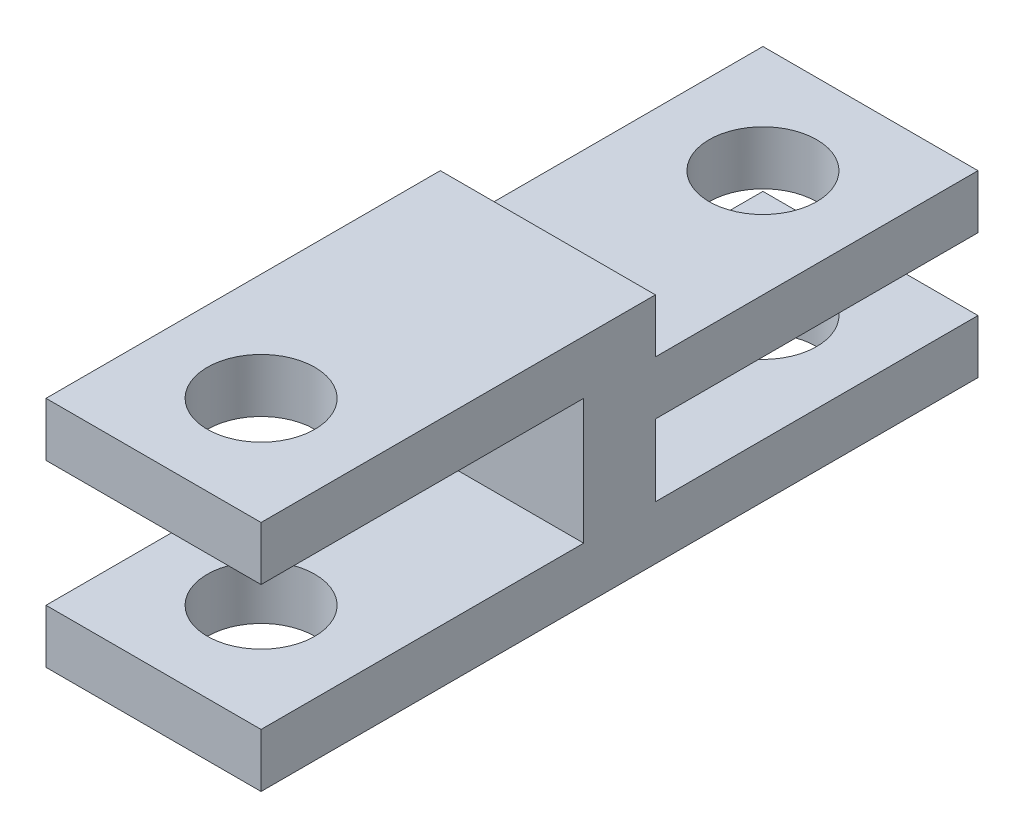
ISO-10303-21;
HEADER;
FILE_DESCRIPTION(('STEP AP214'),'2;1');
FILE_NAME('part.step','',(''),(''),'','','');
FILE_SCHEMA(('AUTOMOTIVE_DESIGN { 1 0 10303 214 1 1 1 1 }'));
ENDSEC;
DATA;
#1=APPLICATION_CONTEXT('core data for automotive mechanical design processes');
#2=APPLICATION_PROTOCOL_DEFINITION('international standard','automotive_design',2000,#1);
#3=PRODUCT_CONTEXT('',#1,'mechanical');
#4=PRODUCT('Part','Part','',(#3));
#5=PRODUCT_RELATED_PRODUCT_CATEGORY('part','',(#4));
#6=PRODUCT_DEFINITION_FORMATION('','',#4);
#7=PRODUCT_DEFINITION_CONTEXT('part definition',#1,'design');
#8=PRODUCT_DEFINITION('design','',#6,#7);
#9=PRODUCT_DEFINITION_SHAPE('','',#8);
#10=(LENGTH_UNIT() NAMED_UNIT(*) SI_UNIT(.MILLI.,.METRE.));
#11=(NAMED_UNIT(*) PLANE_ANGLE_UNIT() SI_UNIT($,.RADIAN.));
#12=(NAMED_UNIT(*) SI_UNIT($,.STERADIAN.) SOLID_ANGLE_UNIT());
#13=UNCERTAINTY_MEASURE_WITH_UNIT(LENGTH_MEASURE(1.E-05),#10,'distance_accuracy_value','');
#14=(GEOMETRIC_REPRESENTATION_CONTEXT(3) GLOBAL_UNCERTAINTY_ASSIGNED_CONTEXT((#13)) GLOBAL_UNIT_ASSIGNED_CONTEXT((#10,
#11,#12)) REPRESENTATION_CONTEXT('',''));
#15=CARTESIAN_POINT('',(0.,0.,0.));
#16=DIRECTION('',(0.,0.,1.));
#17=DIRECTION('',(1.,0.,0.));
#18=AXIS2_PLACEMENT_3D('',#15,#16,#17);
#19=CARTESIAN_POINT('',(6.,1.5,0.));
#20=DIRECTION('',(0.,0.,1.));
#21=DIRECTION('',(0.,-1.,0.));
#22=AXIS2_PLACEMENT_3D('',#19,#20,#21);
#23=PLANE('',#22);
#24=DIRECTION('',(0.,1.,0.));
#25=VECTOR('',#24,1.);
#26=CARTESIAN_POINT('',(0.,1.5,0.));
#27=LINE('',#26,#25);
#28=CARTESIAN_POINT('',(0.,0.,0.));
#29=VERTEX_POINT('',#28);
#30=CARTESIAN_POINT('',(0.,1.5,0.));
#31=VERTEX_POINT('',#30);
#32=EDGE_CURVE('E169',#29,#31,#27,.T.);
#33=ORIENTED_EDGE('',*,*,#32,.T.);
#34=DIRECTION('',(-1.,0.,0.));
#35=VECTOR('',#34,1.);
#36=CARTESIAN_POINT('',(6.,1.5,0.));
#37=LINE('',#36,#35);
#38=CARTESIAN_POINT('',(6.,1.5,0.));
#39=VERTEX_POINT('',#38);
#40=EDGE_CURVE('E11',#39,#31,#37,.T.);
#41=ORIENTED_EDGE('',*,*,#40,.F.);
#42=DIRECTION('',(0.,1.,0.));
#43=VECTOR('',#42,1.);
#44=CARTESIAN_POINT('',(6.,1.5,0.));
#45=LINE('',#44,#43);
#46=CARTESIAN_POINT('',(6.,0.,0.));
#47=VERTEX_POINT('',#46);
#48=EDGE_CURVE('E196',#47,#39,#45,.T.);
#49=ORIENTED_EDGE('',*,*,#48,.F.);
#50=DIRECTION('',(-1.,0.,0.));
#51=VECTOR('',#50,1.);
#52=CARTESIAN_POINT('',(6.,0.,0.));
#53=LINE('',#52,#51);
#54=EDGE_CURVE('E165',#47,#29,#53,.T.);
#55=ORIENTED_EDGE('',*,*,#54,.T.);
#56=EDGE_LOOP('',(#33,#41,#49,#55));
#57=FACE_BOUND('',#56,.T.);
#58=ADVANCED_FACE('F35',(#57),#23,.F.);
#59=CARTESIAN_POINT('',(6.,1.5,9.));
#60=DIRECTION('',(0.,-1.,0.));
#61=DIRECTION('',(0.,0.,-1.));
#62=AXIS2_PLACEMENT_3D('',#59,#60,#61);
#63=PLANE('',#62);
#64=CARTESIAN_POINT('',(3.,1.5,3.));
#65=DIRECTION('',(0.,-1.,0.));
#66=DIRECTION('',(0.,0.,-1.));
#67=AXIS2_PLACEMENT_3D('',#64,#65,#66);
#68=CIRCLE('',#67,1.5);
#69=CARTESIAN_POINT('',(3.,1.5,1.5));
#70=VERTEX_POINT('',#69);
#71=EDGE_CURVE('E173',#70,#70,#68,.T.);
#72=ORIENTED_EDGE('',*,*,#71,.T.);
#73=EDGE_LOOP('',(#72));
#74=FACE_BOUND('',#73,.T.);
#75=DIRECTION('',(0.,0.,1.));
#76=VECTOR('',#75,1.);
#77=CARTESIAN_POINT('',(0.,1.5,9.));
#78=LINE('',#77,#76);
#79=CARTESIAN_POINT('',(0.,1.5,9.));
#80=VERTEX_POINT('',#79);
#81=EDGE_CURVE('E172',#31,#80,#78,.T.);
#82=ORIENTED_EDGE('',*,*,#81,.T.);
#83=DIRECTION('',(-1.,0.,0.));
#84=VECTOR('',#83,1.);
#85=CARTESIAN_POINT('',(6.,1.5,9.));
#86=LINE('',#85,#84);
#87=CARTESIAN_POINT('',(6.,1.5,9.));
#88=VERTEX_POINT('',#87);
#89=EDGE_CURVE('E44',#88,#80,#86,.T.);
#90=ORIENTED_EDGE('',*,*,#89,.F.);
#91=DIRECTION('',(0.,0.,1.));
#92=VECTOR('',#91,1.);
#93=CARTESIAN_POINT('',(6.,1.5,9.));
#94=LINE('',#93,#92);
#95=EDGE_CURVE('E114',#39,#88,#94,.T.);
#96=ORIENTED_EDGE('',*,*,#95,.F.);
#97=ORIENTED_EDGE('',*,*,#40,.T.);
#98=EDGE_LOOP('',(#82,#90,#96,#97));
#99=FACE_BOUND('',#98,.T.);
#100=ADVANCED_FACE('F296',(#74,#99),#63,.F.);
#101=CARTESIAN_POINT('',(6.,3.5,9.));
#102=DIRECTION('',(0.,0.,1.));
#103=DIRECTION('',(1.,0.,0.));
#104=AXIS2_PLACEMENT_3D('',#101,#102,#103);
#105=PLANE('',#104);
#106=DIRECTION('',(0.,1.,0.));
#107=VECTOR('',#106,1.);
#108=CARTESIAN_POINT('',(0.,3.5,9.));
#109=LINE('',#108,#107);
#110=CARTESIAN_POINT('',(0.,3.5,9.));
#111=VERTEX_POINT('',#110);
#112=EDGE_CURVE('E175',#80,#111,#109,.T.);
#113=ORIENTED_EDGE('',*,*,#112,.T.);
#114=DIRECTION('',(-1.,0.,0.));
#115=VECTOR('',#114,1.);
#116=CARTESIAN_POINT('',(6.,3.5,9.));
#117=LINE('',#116,#115);
#118=CARTESIAN_POINT('',(6.,3.5,9.));
#119=VERTEX_POINT('',#118);
#120=EDGE_CURVE('E221',#119,#111,#117,.T.);
#121=ORIENTED_EDGE('',*,*,#120,.F.);
#122=DIRECTION('',(0.,1.,0.));
#123=VECTOR('',#122,1.);
#124=CARTESIAN_POINT('',(6.,3.5,9.));
#125=LINE('',#124,#123);
#126=EDGE_CURVE('E251',#88,#119,#125,.T.);
#127=ORIENTED_EDGE('',*,*,#126,.F.);
#128=ORIENTED_EDGE('',*,*,#89,.T.);
#129=EDGE_LOOP('',(#113,#121,#127,#128));
#130=FACE_BOUND('',#129,.T.);
#131=ADVANCED_FACE('F300',(#130),#105,.F.);
#132=CARTESIAN_POINT('',(6.,3.5,0.));
#133=DIRECTION('',(0.,1.,0.));
#134=DIRECTION('',(0.,0.,1.));
#135=AXIS2_PLACEMENT_3D('',#132,#133,#134);
#136=PLANE('',#135);
#137=CARTESIAN_POINT('',(3.,3.5,3.));
#138=DIRECTION('',(0.,1.,0.));
#139=DIRECTION('',(0.,0.,1.));
#140=AXIS2_PLACEMENT_3D('',#137,#138,#139);
#141=CIRCLE('',#140,1.5);
#142=CARTESIAN_POINT('',(3.,3.5,4.5));
#143=VERTEX_POINT('',#142);
#144=EDGE_CURVE('E244',#143,#143,#141,.T.);
#145=ORIENTED_EDGE('',*,*,#144,.T.);
#146=EDGE_LOOP('',(#145));
#147=FACE_BOUND('',#146,.T.);
#148=DIRECTION('',(0.,0.,-1.));
#149=VECTOR('',#148,1.);
#150=CARTESIAN_POINT('',(0.,3.5,0.));
#151=LINE('',#150,#149);
#152=CARTESIAN_POINT('',(0.,3.5,0.));
#153=VERTEX_POINT('',#152);
#154=EDGE_CURVE('E177',#111,#153,#151,.T.);
#155=ORIENTED_EDGE('',*,*,#154,.T.);
#156=DIRECTION('',(-1.,0.,0.));
#157=VECTOR('',#156,1.);
#158=CARTESIAN_POINT('',(6.,3.5,0.));
#159=LINE('',#158,#157);
#160=CARTESIAN_POINT('',(6.,3.5,0.));
#161=VERTEX_POINT('',#160);
#162=EDGE_CURVE('E218',#161,#153,#159,.T.);
#163=ORIENTED_EDGE('',*,*,#162,.F.);
#164=DIRECTION('',(0.,0.,-1.));
#165=VECTOR('',#164,1.);
#166=CARTESIAN_POINT('',(6.,3.5,0.));
#167=LINE('',#166,#165);
#168=EDGE_CURVE('E253',#119,#161,#167,.T.);
#169=ORIENTED_EDGE('',*,*,#168,.F.);
#170=ORIENTED_EDGE('',*,*,#120,.T.);
#171=EDGE_LOOP('',(#155,#163,#169,#170));
#172=FACE_BOUND('',#171,.T.);
#173=ADVANCED_FACE('F305',(#147,#172),#136,.F.);
#174=CARTESIAN_POINT('',(6.,5.,0.));
#175=DIRECTION('',(0.,0.,1.));
#176=DIRECTION('',(0.,-1.,0.));
#177=AXIS2_PLACEMENT_3D('',#174,#175,#176);
#178=PLANE('',#177);
#179=DIRECTION('',(0.,1.,0.));
#180=VECTOR('',#179,1.);
#181=CARTESIAN_POINT('',(0.,5.,0.));
#182=LINE('',#181,#180);
#183=CARTESIAN_POINT('',(0.,5.,0.));
#184=VERTEX_POINT('',#183);
#185=EDGE_CURVE('E179',#153,#184,#182,.T.);
#186=ORIENTED_EDGE('',*,*,#185,.T.);
#187=DIRECTION('',(-1.,0.,0.));
#188=VECTOR('',#187,1.);
#189=CARTESIAN_POINT('',(6.,5.,0.));
#190=LINE('',#189,#188);
#191=CARTESIAN_POINT('',(6.,5.,0.));
#192=VERTEX_POINT('',#191);
#193=EDGE_CURVE('E215',#192,#184,#190,.T.);
#194=ORIENTED_EDGE('',*,*,#193,.F.);
#195=DIRECTION('',(0.,1.,0.));
#196=VECTOR('',#195,1.);
#197=CARTESIAN_POINT('',(6.,5.,0.));
#198=LINE('',#197,#196);
#199=EDGE_CURVE('E255',#161,#192,#198,.T.);
#200=ORIENTED_EDGE('',*,*,#199,.F.);
#201=ORIENTED_EDGE('',*,*,#162,.T.);
#202=EDGE_LOOP('',(#186,#194,#200,#201));
#203=FACE_BOUND('',#202,.T.);
#204=ADVANCED_FACE('F311',(#203),#178,.F.);
#205=CARTESIAN_POINT('',(6.,5.,9.));
#206=DIRECTION('',(0.,-1.,0.));
#207=DIRECTION('',(0.,0.,-1.));
#208=AXIS2_PLACEMENT_3D('',#205,#206,#207);
#209=PLANE('',#208);
#210=CARTESIAN_POINT('',(3.,5.,3.));
#211=DIRECTION('',(0.,-1.,0.));
#212=DIRECTION('',(0.,0.,-1.));
#213=AXIS2_PLACEMENT_3D('',#210,#211,#212);
#214=CIRCLE('',#213,1.5);
#215=CARTESIAN_POINT('',(3.,5.,1.5));
#216=VERTEX_POINT('',#215);
#217=EDGE_CURVE('E241',#216,#216,#214,.T.);
#218=ORIENTED_EDGE('',*,*,#217,.T.);
#219=EDGE_LOOP('',(#218));
#220=FACE_BOUND('',#219,.T.);
#221=DIRECTION('',(0.,0.,1.));
#222=VECTOR('',#221,1.);
#223=CARTESIAN_POINT('',(0.,5.,9.));
#224=LINE('',#223,#222);
#225=CARTESIAN_POINT('',(0.,5.,9.));
#226=VERTEX_POINT('',#225);
#227=EDGE_CURVE('E181',#184,#226,#224,.T.);
#228=ORIENTED_EDGE('',*,*,#227,.T.);
#229=DIRECTION('',(-1.,0.,0.));
#230=VECTOR('',#229,1.);
#231=CARTESIAN_POINT('',(6.,5.,9.));
#232=LINE('',#231,#230);
#233=CARTESIAN_POINT('',(6.,5.,9.));
#234=VERTEX_POINT('',#233);
#235=EDGE_CURVE('E212',#234,#226,#232,.T.);
#236=ORIENTED_EDGE('',*,*,#235,.F.);
#237=DIRECTION('',(0.,0.,1.));
#238=VECTOR('',#237,1.);
#239=CARTESIAN_POINT('',(6.,5.,9.));
#240=LINE('',#239,#238);
#241=EDGE_CURVE('E257',#192,#234,#240,.T.);
#242=ORIENTED_EDGE('',*,*,#241,.F.);
#243=ORIENTED_EDGE('',*,*,#193,.T.);
#244=EDGE_LOOP('',(#228,#236,#242,#243));
#245=FACE_BOUND('',#244,.T.);
#246=ADVANCED_FACE('F315',(#220,#245),#209,.F.);
#247=CARTESIAN_POINT('',(6.,6.5,9.));
#248=DIRECTION('',(0.,0.,1.));
#249=DIRECTION('',(1.,0.,0.));
#250=AXIS2_PLACEMENT_3D('',#247,#248,#249);
#251=PLANE('',#250);
#252=DIRECTION('',(0.,1.,0.));
#253=VECTOR('',#252,1.);
#254=CARTESIAN_POINT('',(0.,6.5,9.));
#255=LINE('',#254,#253);
#256=CARTESIAN_POINT('',(0.,6.5,9.));
#257=VERTEX_POINT('',#256);
#258=EDGE_CURVE('E183',#226,#257,#255,.T.);
#259=ORIENTED_EDGE('',*,*,#258,.T.);
#260=DIRECTION('',(-1.,0.,0.));
#261=VECTOR('',#260,1.);
#262=CARTESIAN_POINT('',(6.,6.5,9.));
#263=LINE('',#262,#261);
#264=CARTESIAN_POINT('',(6.,6.5,9.));
#265=VERTEX_POINT('',#264);
#266=EDGE_CURVE('E209',#265,#257,#263,.T.);
#267=ORIENTED_EDGE('',*,*,#266,.F.);
#268=DIRECTION('',(0.,1.,0.));
#269=VECTOR('',#268,1.);
#270=CARTESIAN_POINT('',(6.,6.5,9.));
#271=LINE('',#270,#269);
#272=EDGE_CURVE('E259',#234,#265,#271,.T.);
#273=ORIENTED_EDGE('',*,*,#272,.F.);
#274=ORIENTED_EDGE('',*,*,#235,.T.);
#275=EDGE_LOOP('',(#259,#267,#273,#274));
#276=FACE_BOUND('',#275,.T.);
#277=ADVANCED_FACE('F319',(#276),#251,.F.);
#278=CARTESIAN_POINT('',(6.,6.5,20.));
#279=DIRECTION('',(0.,-1.,0.));
#280=DIRECTION('',(0.,0.,-1.));
#281=AXIS2_PLACEMENT_3D('',#278,#279,#280);
#282=PLANE('',#281);
#283=CARTESIAN_POINT('',(3.,6.5,17.));
#284=DIRECTION('',(0.,-1.,0.));
#285=DIRECTION('',(0.,0.,-1.));
#286=AXIS2_PLACEMENT_3D('',#283,#284,#285);
#287=CIRCLE('',#286,1.5);
#288=CARTESIAN_POINT('',(3.,6.5,15.5));
#289=VERTEX_POINT('',#288);
#290=EDGE_CURVE('E228',#289,#289,#287,.T.);
#291=ORIENTED_EDGE('',*,*,#290,.T.);
#292=EDGE_LOOP('',(#291));
#293=FACE_BOUND('',#292,.T.);
#294=DIRECTION('',(0.,0.,1.));
#295=VECTOR('',#294,1.);
#296=CARTESIAN_POINT('',(0.,6.5,20.));
#297=LINE('',#296,#295);
#298=CARTESIAN_POINT('',(0.,6.5,20.));
#299=VERTEX_POINT('',#298);
#300=EDGE_CURVE('E185',#257,#299,#297,.T.);
#301=ORIENTED_EDGE('',*,*,#300,.T.);
#302=DIRECTION('',(-1.,0.,0.));
#303=VECTOR('',#302,1.);
#304=CARTESIAN_POINT('',(6.,6.5,20.));
#305=LINE('',#304,#303);
#306=CARTESIAN_POINT('',(6.,6.5,20.));
#307=VERTEX_POINT('',#306);
#308=EDGE_CURVE('E206',#307,#299,#305,.T.);
#309=ORIENTED_EDGE('',*,*,#308,.F.);
#310=DIRECTION('',(0.,0.,1.));
#311=VECTOR('',#310,1.);
#312=CARTESIAN_POINT('',(6.,6.5,20.));
#313=LINE('',#312,#311);
#314=EDGE_CURVE('E261',#265,#307,#313,.T.);
#315=ORIENTED_EDGE('',*,*,#314,.F.);
#316=ORIENTED_EDGE('',*,*,#266,.T.);
#317=EDGE_LOOP('',(#301,#309,#315,#316));
#318=FACE_BOUND('',#317,.T.);
#319=ADVANCED_FACE('F323',(#293,#318),#282,.F.);
#320=CARTESIAN_POINT('',(6.,5.,20.));
#321=DIRECTION('',(0.,0.,-1.));
#322=DIRECTION('',(-1.,0.,0.));
#323=AXIS2_PLACEMENT_3D('',#320,#321,#322);
#324=PLANE('',#323);
#325=DIRECTION('',(0.,-1.,0.));
#326=VECTOR('',#325,1.);
#327=CARTESIAN_POINT('',(0.,5.,20.));
#328=LINE('',#327,#326);
#329=CARTESIAN_POINT('',(0.,5.,20.));
#330=VERTEX_POINT('',#329);
#331=EDGE_CURVE('E187',#299,#330,#328,.T.);
#332=ORIENTED_EDGE('',*,*,#331,.T.);
#333=DIRECTION('',(-1.,0.,0.));
#334=VECTOR('',#333,1.);
#335=CARTESIAN_POINT('',(6.,5.,20.));
#336=LINE('',#335,#334);
#337=CARTESIAN_POINT('',(6.,5.,20.));
#338=VERTEX_POINT('',#337);
#339=EDGE_CURVE('E203',#338,#330,#336,.T.);
#340=ORIENTED_EDGE('',*,*,#339,.F.);
#341=DIRECTION('',(0.,-1.,0.));
#342=VECTOR('',#341,1.);
#343=CARTESIAN_POINT('',(6.,5.,20.));
#344=LINE('',#343,#342);
#345=EDGE_CURVE('E263',#307,#338,#344,.T.);
#346=ORIENTED_EDGE('',*,*,#345,.F.);
#347=ORIENTED_EDGE('',*,*,#308,.T.);
#348=EDGE_LOOP('',(#332,#340,#346,#347));
#349=FACE_BOUND('',#348,.T.);
#350=ADVANCED_FACE('F327',(#349),#324,.F.);
#351=CARTESIAN_POINT('',(6.,5.,11.));
#352=DIRECTION('',(0.,1.,0.));
#353=DIRECTION('',(0.,0.,1.));
#354=AXIS2_PLACEMENT_3D('',#351,#352,#353);
#355=PLANE('',#354);
#356=CARTESIAN_POINT('',(3.,5.,17.));
#357=DIRECTION('',(0.,1.,0.));
#358=DIRECTION('',(0.,0.,1.));
#359=AXIS2_PLACEMENT_3D('',#356,#357,#358);
#360=CIRCLE('',#359,1.5);
#361=CARTESIAN_POINT('',(3.,5.,18.5));
#362=VERTEX_POINT('',#361);
#363=EDGE_CURVE('E232',#362,#362,#360,.T.);
#364=ORIENTED_EDGE('',*,*,#363,.T.);
#365=EDGE_LOOP('',(#364));
#366=FACE_BOUND('',#365,.T.);
#367=DIRECTION('',(0.,0.,-1.));
#368=VECTOR('',#367,1.);
#369=CARTESIAN_POINT('',(0.,5.,11.));
#370=LINE('',#369,#368);
#371=CARTESIAN_POINT('',(0.,5.,11.));
#372=VERTEX_POINT('',#371);
#373=EDGE_CURVE('E189',#330,#372,#370,.T.);
#374=ORIENTED_EDGE('',*,*,#373,.T.);
#375=DIRECTION('',(-1.,0.,0.));
#376=VECTOR('',#375,1.);
#377=CARTESIAN_POINT('',(6.,5.,11.));
#378=LINE('',#377,#376);
#379=CARTESIAN_POINT('',(6.,5.,11.));
#380=VERTEX_POINT('',#379);
#381=EDGE_CURVE('E200',#380,#372,#378,.T.);
#382=ORIENTED_EDGE('',*,*,#381,.F.);
#383=DIRECTION('',(0.,0.,-1.));
#384=VECTOR('',#383,1.);
#385=CARTESIAN_POINT('',(6.,5.,11.));
#386=LINE('',#385,#384);
#387=EDGE_CURVE('E265',#338,#380,#386,.T.);
#388=ORIENTED_EDGE('',*,*,#387,.F.);
#389=ORIENTED_EDGE('',*,*,#339,.T.);
#390=EDGE_LOOP('',(#374,#382,#388,#389));
#391=FACE_BOUND('',#390,.T.);
#392=ADVANCED_FACE('F271',(#366,#391),#355,.F.);
#393=CARTESIAN_POINT('',(6.,1.5,11.));
#394=DIRECTION('',(0.,0.,-1.));
#395=DIRECTION('',(0.,1.,0.));
#396=AXIS2_PLACEMENT_3D('',#393,#394,#395);
#397=PLANE('',#396);
#398=DIRECTION('',(0.,-1.,0.));
#399=VECTOR('',#398,1.);
#400=CARTESIAN_POINT('',(0.,1.5,11.));
#401=LINE('',#400,#399);
#402=CARTESIAN_POINT('',(0.,1.5,11.));
#403=VERTEX_POINT('',#402);
#404=EDGE_CURVE('E191',#372,#403,#401,.T.);
#405=ORIENTED_EDGE('',*,*,#404,.T.);
#406=DIRECTION('',(-1.,0.,0.));
#407=VECTOR('',#406,1.);
#408=CARTESIAN_POINT('',(6.,1.5,11.));
#409=LINE('',#408,#407);
#410=CARTESIAN_POINT('',(6.,1.5,11.));
#411=VERTEX_POINT('',#410);
#412=EDGE_CURVE('E160',#411,#403,#409,.T.);
#413=ORIENTED_EDGE('',*,*,#412,.F.);
#414=DIRECTION('',(0.,-1.,0.));
#415=VECTOR('',#414,1.);
#416=CARTESIAN_POINT('',(6.,1.5,11.));
#417=LINE('',#416,#415);
#418=EDGE_CURVE('E151',#380,#411,#417,.T.);
#419=ORIENTED_EDGE('',*,*,#418,.F.);
#420=ORIENTED_EDGE('',*,*,#381,.T.);
#421=EDGE_LOOP('',(#405,#413,#419,#420));
#422=FACE_BOUND('',#421,.T.);
#423=ADVANCED_FACE('F275',(#422),#397,.F.);
#424=CARTESIAN_POINT('',(6.,1.5,20.));
#425=DIRECTION('',(0.,-1.,0.));
#426=DIRECTION('',(0.,0.,-1.));
#427=AXIS2_PLACEMENT_3D('',#424,#425,#426);
#428=PLANE('',#427);
#429=CARTESIAN_POINT('',(3.,1.5,17.));
#430=DIRECTION('',(0.,-1.,0.));
#431=DIRECTION('',(0.,0.,-1.));
#432=AXIS2_PLACEMENT_3D('',#429,#430,#431);
#433=CIRCLE('',#432,1.5);
#434=CARTESIAN_POINT('',(3.,1.5,15.5));
#435=VERTEX_POINT('',#434);
#436=EDGE_CURVE('E227',#435,#435,#433,.T.);
#437=ORIENTED_EDGE('',*,*,#436,.T.);
#438=EDGE_LOOP('',(#437));
#439=FACE_BOUND('',#438,.T.);
#440=DIRECTION('',(0.,0.,1.));
#441=VECTOR('',#440,1.);
#442=CARTESIAN_POINT('',(0.,1.5,20.));
#443=LINE('',#442,#441);
#444=CARTESIAN_POINT('',(0.,1.5,20.));
#445=VERTEX_POINT('',#444);
#446=EDGE_CURVE('E159',#403,#445,#443,.T.);
#447=ORIENTED_EDGE('',*,*,#446,.T.);
#448=DIRECTION('',(-1.,0.,0.));
#449=VECTOR('',#448,1.);
#450=CARTESIAN_POINT('',(6.,1.5,20.));
#451=LINE('',#450,#449);
#452=CARTESIAN_POINT('',(6.,1.5,20.));
#453=VERTEX_POINT('',#452);
#454=EDGE_CURVE('E156',#453,#445,#451,.T.);
#455=ORIENTED_EDGE('',*,*,#454,.F.);
#456=DIRECTION('',(0.,0.,1.));
#457=VECTOR('',#456,1.);
#458=CARTESIAN_POINT('',(6.,1.5,20.));
#459=LINE('',#458,#457);
#460=EDGE_CURVE('E145',#411,#453,#459,.T.);
#461=ORIENTED_EDGE('',*,*,#460,.F.);
#462=ORIENTED_EDGE('',*,*,#412,.T.);
#463=EDGE_LOOP('',(#447,#455,#461,#462));
#464=FACE_BOUND('',#463,.T.);
#465=ADVANCED_FACE('F157',(#439,#464),#428,.F.);
#466=CARTESIAN_POINT('',(6.,0.,20.));
#467=DIRECTION('',(0.,0.,-1.));
#468=DIRECTION('',(-1.,0.,0.));
#469=AXIS2_PLACEMENT_3D('',#466,#467,#468);
#470=PLANE('',#469);
#471=DIRECTION('',(0.,-1.,0.));
#472=VECTOR('',#471,1.);
#473=CARTESIAN_POINT('',(0.,0.,20.));
#474=LINE('',#473,#472);
#475=CARTESIAN_POINT('',(0.,0.,20.));
#476=VERTEX_POINT('',#475);
#477=EDGE_CURVE('E100',#445,#476,#474,.T.);
#478=ORIENTED_EDGE('',*,*,#477,.T.);
#479=DIRECTION('',(-1.,0.,0.));
#480=VECTOR('',#479,1.);
#481=CARTESIAN_POINT('',(6.,0.,20.));
#482=LINE('',#481,#480);
#483=CARTESIAN_POINT('',(6.,0.,20.));
#484=VERTEX_POINT('',#483);
#485=EDGE_CURVE('E161',#484,#476,#482,.T.);
#486=ORIENTED_EDGE('',*,*,#485,.F.);
#487=DIRECTION('',(0.,-1.,0.));
#488=VECTOR('',#487,1.);
#489=CARTESIAN_POINT('',(6.,0.,20.));
#490=LINE('',#489,#488);
#491=EDGE_CURVE('E149',#453,#484,#490,.T.);
#492=ORIENTED_EDGE('',*,*,#491,.F.);
#493=ORIENTED_EDGE('',*,*,#454,.T.);
#494=EDGE_LOOP('',(#478,#486,#492,#493));
#495=FACE_BOUND('',#494,.T.);
#496=ADVANCED_FACE('F163',(#495),#470,.F.);
#497=CARTESIAN_POINT('',(6.,0.,0.));
#498=DIRECTION('',(0.,1.,0.));
#499=DIRECTION('',(0.,0.,1.));
#500=AXIS2_PLACEMENT_3D('',#497,#498,#499);
#501=PLANE('',#500);
#502=CARTESIAN_POINT('',(3.,0.,3.));
#503=DIRECTION('',(0.,1.,0.));
#504=DIRECTION('',(0.,0.,1.));
#505=AXIS2_PLACEMENT_3D('',#502,#503,#504);
#506=CIRCLE('',#505,1.5);
#507=CARTESIAN_POINT('',(3.,0.,4.5));
#508=VERTEX_POINT('',#507);
#509=EDGE_CURVE('E38',#508,#508,#506,.T.);
#510=ORIENTED_EDGE('',*,*,#509,.T.);
#511=EDGE_LOOP('',(#510));
#512=FACE_BOUND('',#511,.T.);
#513=CARTESIAN_POINT('',(3.,0.,17.));
#514=DIRECTION('',(0.,1.,0.));
#515=DIRECTION('',(0.,0.,1.));
#516=AXIS2_PLACEMENT_3D('',#513,#514,#515);
#517=CIRCLE('',#516,1.5);
#518=CARTESIAN_POINT('',(3.,0.,18.5));
#519=VERTEX_POINT('',#518);
#520=EDGE_CURVE('E225',#519,#519,#517,.T.);
#521=ORIENTED_EDGE('',*,*,#520,.T.);
#522=EDGE_LOOP('',(#521));
#523=FACE_BOUND('',#522,.T.);
#524=DIRECTION('',(0.,0.,-1.));
#525=VECTOR('',#524,1.);
#526=CARTESIAN_POINT('',(0.,0.,0.));
#527=LINE('',#526,#525);
#528=EDGE_CURVE('E106',#476,#29,#527,.T.);
#529=ORIENTED_EDGE('',*,*,#528,.T.);
#530=ORIENTED_EDGE('',*,*,#54,.F.);
#531=DIRECTION('',(0.,0.,-1.));
#532=VECTOR('',#531,1.);
#533=CARTESIAN_POINT('',(6.,0.,0.));
#534=LINE('',#533,#532);
#535=EDGE_CURVE('E53',#484,#47,#534,.T.);
#536=ORIENTED_EDGE('',*,*,#535,.F.);
#537=ORIENTED_EDGE('',*,*,#485,.T.);
#538=EDGE_LOOP('',(#529,#530,#536,#537));
#539=FACE_BOUND('',#538,.T.);
#540=ADVANCED_FACE('F283',(#512,#523,#539),#501,.F.);
#541=CARTESIAN_POINT('',(6.,0.,0.));
#542=DIRECTION('',(-1.,0.,0.));
#543=DIRECTION('',(0.,0.,1.));
#544=AXIS2_PLACEMENT_3D('',#541,#542,#543);
#545=PLANE('',#544);
#546=ORIENTED_EDGE('',*,*,#48,.T.);
#547=ORIENTED_EDGE('',*,*,#95,.T.);
#548=ORIENTED_EDGE('',*,*,#126,.T.);
#549=ORIENTED_EDGE('',*,*,#168,.T.);
#550=ORIENTED_EDGE('',*,*,#199,.T.);
#551=ORIENTED_EDGE('',*,*,#241,.T.);
#552=ORIENTED_EDGE('',*,*,#272,.T.);
#553=ORIENTED_EDGE('',*,*,#314,.T.);
#554=ORIENTED_EDGE('',*,*,#345,.T.);
#555=ORIENTED_EDGE('',*,*,#387,.T.);
#556=ORIENTED_EDGE('',*,*,#418,.T.);
#557=ORIENTED_EDGE('',*,*,#460,.T.);
#558=ORIENTED_EDGE('',*,*,#491,.T.);
#559=ORIENTED_EDGE('',*,*,#535,.T.);
#560=EDGE_LOOP('',(#546,#547,#548,#549,#550,#551,#552,#553,#554,#555,#556,#557,#558,#559));
#561=FACE_BOUND('',#560,.T.);
#562=ADVANCED_FACE('F147',(#561),#545,.F.);
#563=CARTESIAN_POINT('',(0.,0.,0.));
#564=DIRECTION('',(-1.,0.,0.));
#565=DIRECTION('',(0.,0.,1.));
#566=AXIS2_PLACEMENT_3D('',#563,#564,#565);
#567=PLANE('',#566);
#568=ORIENTED_EDGE('',*,*,#32,.F.);
#569=ORIENTED_EDGE('',*,*,#528,.F.);
#570=ORIENTED_EDGE('',*,*,#477,.F.);
#571=ORIENTED_EDGE('',*,*,#446,.F.);
#572=ORIENTED_EDGE('',*,*,#404,.F.);
#573=ORIENTED_EDGE('',*,*,#373,.F.);
#574=ORIENTED_EDGE('',*,*,#331,.F.);
#575=ORIENTED_EDGE('',*,*,#300,.F.);
#576=ORIENTED_EDGE('',*,*,#258,.F.);
#577=ORIENTED_EDGE('',*,*,#227,.F.);
#578=ORIENTED_EDGE('',*,*,#185,.F.);
#579=ORIENTED_EDGE('',*,*,#154,.F.);
#580=ORIENTED_EDGE('',*,*,#112,.F.);
#581=ORIENTED_EDGE('',*,*,#81,.F.);
#582=EDGE_LOOP('',(#568,#569,#570,#571,#572,#573,#574,#575,#576,#577,#578,#579,#580,#581));
#583=FACE_BOUND('',#582,.T.);
#584=ADVANCED_FACE('F278',(#583),#567,.T.);
#585=CARTESIAN_POINT('',(3.,6.5,17.));
#586=DIRECTION('',(0.,-1.,0.));
#587=DIRECTION('',(0.,0.,-1.));
#588=AXIS2_PLACEMENT_3D('',#585,#586,#587);
#589=CYLINDRICAL_SURFACE('',#588,1.5);
#590=ORIENTED_EDGE('',*,*,#520,.F.);
#591=EDGE_LOOP('',(#590));
#592=FACE_BOUND('',#591,.T.);
#593=ORIENTED_EDGE('',*,*,#436,.F.);
#594=EDGE_LOOP('',(#593));
#595=FACE_BOUND('',#594,.T.);
#596=ADVANCED_FACE('F342',(#592,#595),#589,.F.);
#597=CARTESIAN_POINT('',(3.,6.5,3.));
#598=DIRECTION('',(0.,-1.,0.));
#599=DIRECTION('',(0.,0.,-1.));
#600=AXIS2_PLACEMENT_3D('',#597,#598,#599);
#601=CYLINDRICAL_SURFACE('',#600,1.5);
#602=ORIENTED_EDGE('',*,*,#509,.F.);
#603=EDGE_LOOP('',(#602));
#604=FACE_BOUND('',#603,.T.);
#605=ORIENTED_EDGE('',*,*,#71,.F.);
#606=EDGE_LOOP('',(#605));
#607=FACE_BOUND('',#606,.T.);
#608=ADVANCED_FACE('F344',(#604,#607),#601,.F.);
#609=ORIENTED_EDGE('',*,*,#290,.F.);
#610=EDGE_LOOP('',(#609));
#611=FACE_BOUND('',#610,.T.);
#612=ORIENTED_EDGE('',*,*,#363,.F.);
#613=EDGE_LOOP('',(#612));
#614=FACE_BOUND('',#613,.T.);
#615=ADVANCED_FACE('F347',(#611,#614),#589,.F.);
#616=ORIENTED_EDGE('',*,*,#217,.F.);
#617=EDGE_LOOP('',(#616));
#618=FACE_BOUND('',#617,.T.);
#619=ORIENTED_EDGE('',*,*,#144,.F.);
#620=EDGE_LOOP('',(#619));
#621=FACE_BOUND('',#620,.T.);
#622=ADVANCED_FACE('F354',(#618,#621),#601,.F.);
#623=CLOSED_SHELL('',(#58,#100,#131,#173,#204,#246,#277,#319,#350,#392,#423,#465,#496,#540,#562,
#584,#596,#608,#615,#622));
#624=MANIFOLD_SOLID_BREP('B2',#623);
#625=ADVANCED_BREP_SHAPE_REPRESENTATION('',(#18,#624),#14);
#626=SHAPE_DEFINITION_REPRESENTATION(#9,#625);
ENDSEC;
END-ISO-10303-21;
